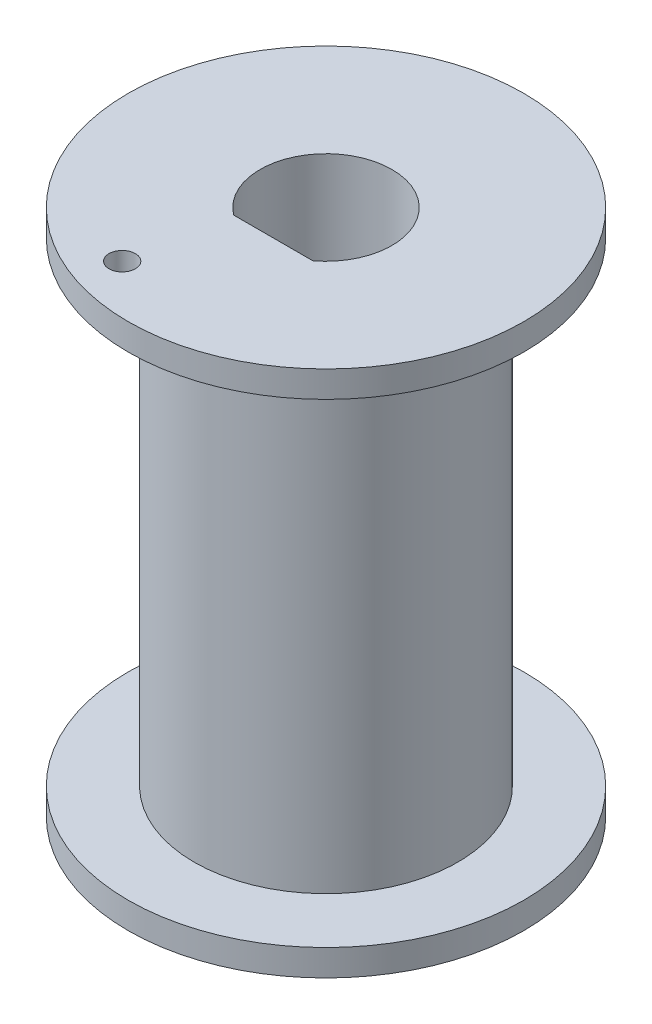
ISO-10303-21;
HEADER;
FILE_DESCRIPTION(('STEP AP214'),'2;1');
FILE_NAME('part.step','',(''),(''),'','','');
FILE_SCHEMA(('AUTOMOTIVE_DESIGN { 1 0 10303 214 1 1 1 1 }'));
ENDSEC;
DATA;
#1=APPLICATION_CONTEXT('core data for automotive mechanical design processes');
#2=APPLICATION_PROTOCOL_DEFINITION('international standard','automotive_design',2000,#1);
#3=PRODUCT_CONTEXT('',#1,'mechanical');
#4=PRODUCT('Part','Part','',(#3));
#5=PRODUCT_RELATED_PRODUCT_CATEGORY('part','',(#4));
#6=PRODUCT_DEFINITION_FORMATION('','',#4);
#7=PRODUCT_DEFINITION_CONTEXT('part definition',#1,'design');
#8=PRODUCT_DEFINITION('design','',#6,#7);
#9=PRODUCT_DEFINITION_SHAPE('','',#8);
#10=(LENGTH_UNIT() NAMED_UNIT(*) SI_UNIT(.MILLI.,.METRE.));
#11=(NAMED_UNIT(*) PLANE_ANGLE_UNIT() SI_UNIT($,.RADIAN.));
#12=(NAMED_UNIT(*) SI_UNIT($,.STERADIAN.) SOLID_ANGLE_UNIT());
#13=UNCERTAINTY_MEASURE_WITH_UNIT(LENGTH_MEASURE(1.E-05),#10,'distance_accuracy_value','');
#14=(GEOMETRIC_REPRESENTATION_CONTEXT(3) GLOBAL_UNCERTAINTY_ASSIGNED_CONTEXT((#13)) GLOBAL_UNIT_ASSIGNED_CONTEXT((#10,
#11,#12)) REPRESENTATION_CONTEXT('',''));
#15=CARTESIAN_POINT('',(0.,0.,0.));
#16=DIRECTION('',(0.,0.,1.));
#17=DIRECTION('',(1.,0.,0.));
#18=AXIS2_PLACEMENT_3D('',#15,#16,#17);
#19=CARTESIAN_POINT('',(0.,20.,0.));
#20=DIRECTION('',(0.,-1.,0.));
#21=DIRECTION('',(0.,0.,-1.));
#22=AXIS2_PLACEMENT_3D('',#19,#20,#21);
#23=CYLINDRICAL_SURFACE('',#22,5.);
#24=CARTESIAN_POINT('',(0.,1.,0.));
#25=DIRECTION('',(0.,-1.,0.));
#26=DIRECTION('',(0.,0.,-1.));
#27=AXIS2_PLACEMENT_3D('',#24,#25,#26);
#28=CIRCLE('',#27,5.);
#29=CARTESIAN_POINT('',(0.,1.,-5.));
#30=VERTEX_POINT('',#29);
#31=EDGE_CURVE('E39',#30,#30,#28,.T.);
#32=ORIENTED_EDGE('',*,*,#31,.F.);
#33=EDGE_LOOP('',(#32));
#34=FACE_BOUND('',#33,.T.);
#35=CARTESIAN_POINT('',(0.,19.,0.));
#36=DIRECTION('',(0.,1.,0.));
#37=DIRECTION('',(0.,0.,1.));
#38=AXIS2_PLACEMENT_3D('',#35,#36,#37);
#39=CIRCLE('',#38,5.);
#40=CARTESIAN_POINT('',(0.,19.,5.));
#41=VERTEX_POINT('',#40);
#42=EDGE_CURVE('E11',#41,#41,#39,.T.);
#43=ORIENTED_EDGE('',*,*,#42,.F.);
#44=EDGE_LOOP('',(#43));
#45=FACE_BOUND('',#44,.T.);
#46=ADVANCED_FACE('F31',(#34,#45),#23,.T.);
#47=CARTESIAN_POINT('',(0.,20.,0.));
#48=DIRECTION('',(0.,1.,0.));
#49=DIRECTION('',(0.,0.,1.));
#50=AXIS2_PLACEMENT_3D('',#47,#48,#49);
#51=PLANE('',#50);
#52=CARTESIAN_POINT('',(-2.10085255696413,20.,5.62819682886584));
#53=DIRECTION('',(0.,-1.,0.));
#54=DIRECTION('',(0.,0.,-1.));
#55=AXIS2_PLACEMENT_3D('',#52,#53,#54);
#56=CIRCLE('',#55,0.5);
#57=CARTESIAN_POINT('',(-2.10085255696413,20.,5.12819682886584));
#58=VERTEX_POINT('',#57);
#59=EDGE_CURVE('E95',#58,#58,#56,.T.);
#60=ORIENTED_EDGE('',*,*,#59,.T.);
#61=EDGE_LOOP('',(#60));
#62=FACE_BOUND('',#61,.T.);
#63=CARTESIAN_POINT('',(0.,20.,0.));
#64=DIRECTION('',(0.,1.,0.));
#65=DIRECTION('',(0.,0.,1.));
#66=AXIS2_PLACEMENT_3D('',#63,#64,#65);
#67=CIRCLE('',#66,2.5);
#68=CARTESIAN_POINT('',(1.5,20.,2.));
#69=VERTEX_POINT('',#68);
#70=CARTESIAN_POINT('',(-1.5,20.,2.));
#71=VERTEX_POINT('',#70);
#72=EDGE_CURVE('E34',#69,#71,#67,.T.);
#73=ORIENTED_EDGE('',*,*,#72,.F.);
#74=DIRECTION('',(-1.,0.,0.));
#75=VECTOR('',#74,1.);
#76=CARTESIAN_POINT('',(1.5,20.,2.));
#77=LINE('',#76,#75);
#78=EDGE_CURVE('E70',#69,#71,#77,.T.);
#79=ORIENTED_EDGE('',*,*,#78,.T.);
#80=EDGE_LOOP('',(#73,#79));
#81=FACE_BOUND('',#80,.T.);
#82=CARTESIAN_POINT('',(0.,20.,0.));
#83=DIRECTION('',(0.,1.,0.));
#84=DIRECTION('',(0.,0.,1.));
#85=AXIS2_PLACEMENT_3D('',#82,#83,#84);
#86=CIRCLE('',#85,7.5);
#87=CARTESIAN_POINT('',(0.,20.,7.5));
#88=VERTEX_POINT('',#87);
#89=EDGE_CURVE('E92',#88,#88,#86,.T.);
#90=ORIENTED_EDGE('',*,*,#89,.T.);
#91=EDGE_LOOP('',(#90));
#92=FACE_BOUND('',#91,.T.);
#93=ADVANCED_FACE('F68',(#62,#81,#92),#51,.T.);
#94=CARTESIAN_POINT('',(0.,0.,0.));
#95=DIRECTION('',(0.,1.,0.));
#96=DIRECTION('',(0.,0.,1.));
#97=AXIS2_PLACEMENT_3D('',#94,#95,#96);
#98=PLANE('',#97);
#99=CARTESIAN_POINT('',(0.,0.,0.));
#100=DIRECTION('',(0.,1.,0.));
#101=DIRECTION('',(0.,0.,1.));
#102=AXIS2_PLACEMENT_3D('',#99,#100,#101);
#103=CIRCLE('',#102,2.5);
#104=CARTESIAN_POINT('',(0.,0.,2.5));
#105=VERTEX_POINT('',#104);
#106=EDGE_CURVE('E71',#105,#105,#103,.T.);
#107=ORIENTED_EDGE('',*,*,#106,.T.);
#108=EDGE_LOOP('',(#107));
#109=FACE_BOUND('',#108,.T.);
#110=CARTESIAN_POINT('',(0.,0.,0.));
#111=DIRECTION('',(0.,-1.,0.));
#112=DIRECTION('',(0.,0.,-1.));
#113=AXIS2_PLACEMENT_3D('',#110,#111,#112);
#114=CIRCLE('',#113,7.5);
#115=CARTESIAN_POINT('',(0.,0.,-7.5));
#116=VERTEX_POINT('',#115);
#117=EDGE_CURVE('E77',#116,#116,#114,.T.);
#118=ORIENTED_EDGE('',*,*,#117,.T.);
#119=EDGE_LOOP('',(#118));
#120=FACE_BOUND('',#119,.T.);
#121=ADVANCED_FACE('F126',(#109,#120),#98,.F.);
#122=CARTESIAN_POINT('',(0.,0.,0.));
#123=DIRECTION('',(0.,1.,0.));
#124=DIRECTION('',(0.,0.,1.));
#125=AXIS2_PLACEMENT_3D('',#122,#123,#124);
#126=CYLINDRICAL_SURFACE('',#125,2.5);
#127=ORIENTED_EDGE('',*,*,#72,.T.);
#128=DIRECTION('',(0.,1.,0.));
#129=VECTOR('',#128,1.);
#130=CARTESIAN_POINT('',(-1.5,2.,2.));
#131=LINE('',#130,#129);
#132=CARTESIAN_POINT('',(-1.5,2.,2.));
#133=VERTEX_POINT('',#132);
#134=EDGE_CURVE('E47',#133,#71,#131,.T.);
#135=ORIENTED_EDGE('',*,*,#134,.F.);
#136=CARTESIAN_POINT('',(0.,2.,0.));
#137=DIRECTION('',(0.,1.,0.));
#138=DIRECTION('',(0.,0.,1.));
#139=AXIS2_PLACEMENT_3D('',#136,#137,#138);
#140=CIRCLE('',#139,2.5);
#141=CARTESIAN_POINT('',(1.5,2.,2.));
#142=VERTEX_POINT('',#141);
#143=EDGE_CURVE('E51',#133,#142,#140,.T.);
#144=ORIENTED_EDGE('',*,*,#143,.T.);
#145=DIRECTION('',(0.,1.,0.));
#146=VECTOR('',#145,1.);
#147=CARTESIAN_POINT('',(1.5,2.,2.));
#148=LINE('',#147,#146);
#149=EDGE_CURVE('E56',#142,#69,#148,.T.);
#150=ORIENTED_EDGE('',*,*,#149,.T.);
#151=EDGE_LOOP('',(#127,#135,#144,#150));
#152=FACE_BOUND('',#151,.T.);
#153=ORIENTED_EDGE('',*,*,#106,.F.);
#154=EDGE_LOOP('',(#153));
#155=FACE_BOUND('',#154,.T.);
#156=ADVANCED_FACE('F58',(#152,#155),#126,.F.);
#157=CARTESIAN_POINT('',(1.5,2.,2.));
#158=DIRECTION('',(0.,0.,-1.));
#159=DIRECTION('',(-1.,0.,0.));
#160=AXIS2_PLACEMENT_3D('',#157,#158,#159);
#161=PLANE('',#160);
#162=ORIENTED_EDGE('',*,*,#78,.F.);
#163=ORIENTED_EDGE('',*,*,#149,.F.);
#164=DIRECTION('',(-1.,0.,0.));
#165=VECTOR('',#164,1.);
#166=CARTESIAN_POINT('',(1.5,2.,2.));
#167=LINE('',#166,#165);
#168=EDGE_CURVE('E65',#142,#133,#167,.T.);
#169=ORIENTED_EDGE('',*,*,#168,.T.);
#170=ORIENTED_EDGE('',*,*,#134,.T.);
#171=EDGE_LOOP('',(#162,#163,#169,#170));
#172=FACE_BOUND('',#171,.T.);
#173=ADVANCED_FACE('F72',(#172),#161,.T.);
#174=CARTESIAN_POINT('',(0.,2.,0.));
#175=DIRECTION('',(0.,1.,0.));
#176=DIRECTION('',(0.,0.,1.));
#177=AXIS2_PLACEMENT_3D('',#174,#175,#176);
#178=PLANE('',#177);
#179=ORIENTED_EDGE('',*,*,#143,.F.);
#180=ORIENTED_EDGE('',*,*,#168,.F.);
#181=EDGE_LOOP('',(#179,#180));
#182=FACE_BOUND('',#181,.T.);
#183=ADVANCED_FACE('F136',(#182),#178,.F.);
#184=CARTESIAN_POINT('',(0.,1.,0.));
#185=DIRECTION('',(0.,-1.,0.));
#186=DIRECTION('',(0.,0.,-1.));
#187=AXIS2_PLACEMENT_3D('',#184,#185,#186);
#188=PLANE('',#187);
#189=CARTESIAN_POINT('',(0.,1.,0.));
#190=DIRECTION('',(0.,-1.,0.));
#191=DIRECTION('',(0.,0.,-1.));
#192=AXIS2_PLACEMENT_3D('',#189,#190,#191);
#193=CIRCLE('',#192,7.5);
#194=CARTESIAN_POINT('',(0.,1.,-7.5));
#195=VERTEX_POINT('',#194);
#196=EDGE_CURVE('E73',#195,#195,#193,.T.);
#197=ORIENTED_EDGE('',*,*,#196,.F.);
#198=EDGE_LOOP('',(#197));
#199=FACE_BOUND('',#198,.T.);
#200=ORIENTED_EDGE('',*,*,#31,.T.);
#201=EDGE_LOOP('',(#200));
#202=FACE_BOUND('',#201,.T.);
#203=ADVANCED_FACE('F139',(#199,#202),#188,.F.);
#204=CARTESIAN_POINT('',(0.,1.,0.));
#205=DIRECTION('',(0.,-1.,0.));
#206=DIRECTION('',(0.,0.,-1.));
#207=AXIS2_PLACEMENT_3D('',#204,#205,#206);
#208=CYLINDRICAL_SURFACE('',#207,7.5);
#209=ORIENTED_EDGE('',*,*,#196,.T.);
#210=EDGE_LOOP('',(#209));
#211=FACE_BOUND('',#210,.T.);
#212=ORIENTED_EDGE('',*,*,#117,.F.);
#213=EDGE_LOOP('',(#212));
#214=FACE_BOUND('',#213,.T.);
#215=ADVANCED_FACE('F115',(#211,#214),#208,.T.);
#216=CARTESIAN_POINT('',(0.,19.,0.));
#217=DIRECTION('',(0.,1.,0.));
#218=DIRECTION('',(0.,0.,1.));
#219=AXIS2_PLACEMENT_3D('',#216,#217,#218);
#220=PLANE('',#219);
#221=CARTESIAN_POINT('',(-2.10085255696413,19.,5.62819682886584));
#222=DIRECTION('',(0.,-1.,0.));
#223=DIRECTION('',(0.,0.,-1.));
#224=AXIS2_PLACEMENT_3D('',#221,#222,#223);
#225=CIRCLE('',#224,0.5);
#226=CARTESIAN_POINT('',(-2.10085255696413,19.,5.12819682886584));
#227=VERTEX_POINT('',#226);
#228=EDGE_CURVE('E98',#227,#227,#225,.T.);
#229=ORIENTED_EDGE('',*,*,#228,.F.);
#230=EDGE_LOOP('',(#229));
#231=FACE_BOUND('',#230,.T.);
#232=CARTESIAN_POINT('',(0.,19.,0.));
#233=DIRECTION('',(0.,1.,0.));
#234=DIRECTION('',(0.,0.,1.));
#235=AXIS2_PLACEMENT_3D('',#232,#233,#234);
#236=CIRCLE('',#235,7.5);
#237=CARTESIAN_POINT('',(0.,19.,7.5));
#238=VERTEX_POINT('',#237);
#239=EDGE_CURVE('E90',#238,#238,#236,.T.);
#240=ORIENTED_EDGE('',*,*,#239,.F.);
#241=EDGE_LOOP('',(#240));
#242=FACE_BOUND('',#241,.T.);
#243=ORIENTED_EDGE('',*,*,#42,.T.);
#244=EDGE_LOOP('',(#243));
#245=FACE_BOUND('',#244,.T.);
#246=ADVANCED_FACE('F112',(#231,#242,#245),#220,.F.);
#247=CARTESIAN_POINT('',(0.,19.,0.));
#248=DIRECTION('',(0.,1.,0.));
#249=DIRECTION('',(0.,0.,1.));
#250=AXIS2_PLACEMENT_3D('',#247,#248,#249);
#251=CYLINDRICAL_SURFACE('',#250,7.5);
#252=ORIENTED_EDGE('',*,*,#239,.T.);
#253=EDGE_LOOP('',(#252));
#254=FACE_BOUND('',#253,.T.);
#255=ORIENTED_EDGE('',*,*,#89,.F.);
#256=EDGE_LOOP('',(#255));
#257=FACE_BOUND('',#256,.T.);
#258=ADVANCED_FACE('F108',(#254,#257),#251,.T.);
#259=CARTESIAN_POINT('',(-2.10085255696413,20.,5.62819682886584));
#260=DIRECTION('',(0.,-1.,0.));
#261=DIRECTION('',(0.,0.,-1.));
#262=AXIS2_PLACEMENT_3D('',#259,#260,#261);
#263=CYLINDRICAL_SURFACE('',#262,0.5);
#264=ORIENTED_EDGE('',*,*,#59,.F.);
#265=EDGE_LOOP('',(#264));
#266=FACE_BOUND('',#265,.T.);
#267=ORIENTED_EDGE('',*,*,#228,.T.);
#268=EDGE_LOOP('',(#267));
#269=FACE_BOUND('',#268,.T.);
#270=ADVANCED_FACE('F105',(#266,#269),#263,.F.);
#271=CLOSED_SHELL('',(#46,#93,#121,#156,#173,#183,#203,#215,#246,#258,#270));
#272=MANIFOLD_SOLID_BREP('B2',#271);
#273=ADVANCED_BREP_SHAPE_REPRESENTATION('',(#18,#272),#14);
#274=SHAPE_DEFINITION_REPRESENTATION(#9,#273);
ENDSEC;
END-ISO-10303-21;
